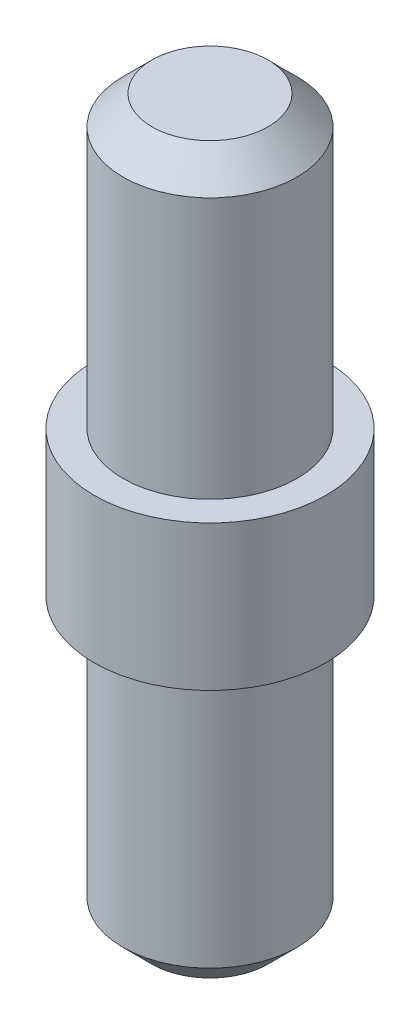
ISO-10303-21;
HEADER;
FILE_DESCRIPTION(('STEP AP214'),'2;1');
FILE_NAME('part.step','',(''),(''),'','','');
FILE_SCHEMA(('AUTOMOTIVE_DESIGN { 1 0 10303 214 1 1 1 1 }'));
ENDSEC;
DATA;
#1=APPLICATION_CONTEXT('core data for automotive mechanical design processes');
#2=APPLICATION_PROTOCOL_DEFINITION('international standard','automotive_design',2000,#1);
#3=PRODUCT_CONTEXT('',#1,'mechanical');
#4=PRODUCT('Part','Part','',(#3));
#5=PRODUCT_RELATED_PRODUCT_CATEGORY('part','',(#4));
#6=PRODUCT_DEFINITION_FORMATION('','',#4);
#7=PRODUCT_DEFINITION_CONTEXT('part definition',#1,'design');
#8=PRODUCT_DEFINITION('design','',#6,#7);
#9=PRODUCT_DEFINITION_SHAPE('','',#8);
#10=(LENGTH_UNIT() NAMED_UNIT(*) SI_UNIT(.MILLI.,.METRE.));
#11=(NAMED_UNIT(*) PLANE_ANGLE_UNIT() SI_UNIT($,.RADIAN.));
#12=(NAMED_UNIT(*) SI_UNIT($,.STERADIAN.) SOLID_ANGLE_UNIT());
#13=UNCERTAINTY_MEASURE_WITH_UNIT(LENGTH_MEASURE(1.E-05),#10,'distance_accuracy_value','');
#14=(GEOMETRIC_REPRESENTATION_CONTEXT(3) GLOBAL_UNCERTAINTY_ASSIGNED_CONTEXT((#13)) GLOBAL_UNIT_ASSIGNED_CONTEXT((#10,
#11,#12)) REPRESENTATION_CONTEXT('',''));
#15=CARTESIAN_POINT('',(0.,0.,0.));
#16=DIRECTION('',(0.,0.,1.));
#17=DIRECTION('',(1.,0.,0.));
#18=AXIS2_PLACEMENT_3D('',#15,#16,#17);
#19=CARTESIAN_POINT('',(0.,0.,0.));
#20=DIRECTION('',(0.,1.,0.));
#21=DIRECTION('',(0.,0.,1.));
#22=AXIS2_PLACEMENT_3D('',#19,#20,#21);
#23=PLANE('',#22);
#24=CARTESIAN_POINT('',(0.,0.,0.));
#25=DIRECTION('',(0.,1.,0.));
#26=DIRECTION('',(0.,0.,1.));
#27=AXIS2_PLACEMENT_3D('',#24,#25,#26);
#28=CIRCLE('',#27,2.00000000000001);
#29=CARTESIAN_POINT('',(0.,0.,2.00000000000001));
#30=VERTEX_POINT('',#29);
#31=EDGE_CURVE('E10',#30,#30,#28,.T.);
#32=ORIENTED_EDGE('',*,*,#31,.F.);
#33=EDGE_LOOP('',(#32));
#34=FACE_BOUND('',#33,.T.);
#35=ADVANCED_FACE('F35',(#34),#23,.F.);
#36=CARTESIAN_POINT('',(0.,0.,0.));
#37=DIRECTION('',(0.,1.,0.));
#38=DIRECTION('',(0.,0.,1.));
#39=AXIS2_PLACEMENT_3D('',#36,#37,#38);
#40=CONICAL_SURFACE('',#39,2.00000000000001,0.785398163397448);
#41=CARTESIAN_POINT('',(0.,1.,0.));
#42=DIRECTION('',(0.,1.,0.));
#43=DIRECTION('',(0.,0.,1.));
#44=AXIS2_PLACEMENT_3D('',#41,#42,#43);
#45=CIRCLE('',#44,3.00000000000001);
#46=CARTESIAN_POINT('',(0.,1.,3.00000000000001));
#47=VERTEX_POINT('',#46);
#48=EDGE_CURVE('E41',#47,#47,#45,.T.);
#49=ORIENTED_EDGE('',*,*,#48,.F.);
#50=EDGE_LOOP('',(#49));
#51=FACE_BOUND('',#50,.T.);
#52=ORIENTED_EDGE('',*,*,#31,.T.);
#53=EDGE_LOOP('',(#52));
#54=FACE_BOUND('',#53,.T.);
#55=ADVANCED_FACE('F101',(#51,#54),#40,.T.);
#56=CARTESIAN_POINT('',(0.,66.7583318306461,0.));
#57=DIRECTION('',(0.,1.,0.));
#58=DIRECTION('',(0.,0.,1.));
#59=AXIS2_PLACEMENT_3D('',#56,#57,#58);
#60=CYLINDRICAL_SURFACE('',#59,3.00000000000001);
#61=CARTESIAN_POINT('',(0.,10.,0.));
#62=DIRECTION('',(0.,1.,0.));
#63=DIRECTION('',(0.,0.,1.));
#64=AXIS2_PLACEMENT_3D('',#61,#62,#63);
#65=CIRCLE('',#64,3.00000000000001);
#66=CARTESIAN_POINT('',(0.,10.,3.00000000000001));
#67=VERTEX_POINT('',#66);
#68=EDGE_CURVE('E45',#67,#67,#65,.T.);
#69=ORIENTED_EDGE('',*,*,#68,.F.);
#70=EDGE_LOOP('',(#69));
#71=FACE_BOUND('',#70,.T.);
#72=ORIENTED_EDGE('',*,*,#48,.T.);
#73=EDGE_LOOP('',(#72));
#74=FACE_BOUND('',#73,.T.);
#75=ADVANCED_FACE('F96',(#71,#74),#60,.T.);
#76=CARTESIAN_POINT('',(3.00000000000001,10.,0.));
#77=DIRECTION('',(0.,1.,0.));
#78=DIRECTION('',(0.,0.,1.));
#79=AXIS2_PLACEMENT_3D('',#76,#77,#78);
#80=PLANE('',#79);
#81=CARTESIAN_POINT('',(0.,10.,0.));
#82=DIRECTION('',(0.,1.,0.));
#83=DIRECTION('',(0.,0.,1.));
#84=AXIS2_PLACEMENT_3D('',#81,#82,#83);
#85=CIRCLE('',#84,4.00000000000001);
#86=CARTESIAN_POINT('',(0.,10.,4.00000000000001));
#87=VERTEX_POINT('',#86);
#88=EDGE_CURVE('E49',#87,#87,#85,.T.);
#89=ORIENTED_EDGE('',*,*,#88,.F.);
#90=EDGE_LOOP('',(#89));
#91=FACE_BOUND('',#90,.T.);
#92=ORIENTED_EDGE('',*,*,#68,.T.);
#93=EDGE_LOOP('',(#92));
#94=FACE_BOUND('',#93,.T.);
#95=ADVANCED_FACE('F90',(#91,#94),#80,.F.);
#96=CARTESIAN_POINT('',(0.,66.7583318306461,0.));
#97=DIRECTION('',(0.,1.,0.));
#98=DIRECTION('',(0.,0.,1.));
#99=AXIS2_PLACEMENT_3D('',#96,#97,#98);
#100=CYLINDRICAL_SURFACE('',#99,4.00000000000001);
#101=CARTESIAN_POINT('',(0.,15.,0.));
#102=DIRECTION('',(0.,1.,0.));
#103=DIRECTION('',(0.,0.,1.));
#104=AXIS2_PLACEMENT_3D('',#101,#102,#103);
#105=CIRCLE('',#104,4.00000000000001);
#106=CARTESIAN_POINT('',(0.,15.,4.00000000000001));
#107=VERTEX_POINT('',#106);
#108=EDGE_CURVE('E54',#107,#107,#105,.T.);
#109=ORIENTED_EDGE('',*,*,#108,.F.);
#110=EDGE_LOOP('',(#109));
#111=FACE_BOUND('',#110,.T.);
#112=ORIENTED_EDGE('',*,*,#88,.T.);
#113=EDGE_LOOP('',(#112));
#114=FACE_BOUND('',#113,.T.);
#115=ADVANCED_FACE('F84',(#111,#114),#100,.T.);
#116=CARTESIAN_POINT('',(3.00000000000001,15.,0.));
#117=DIRECTION('',(0.,-1.,0.));
#118=DIRECTION('',(0.,0.,-1.));
#119=AXIS2_PLACEMENT_3D('',#116,#117,#118);
#120=PLANE('',#119);
#121=CARTESIAN_POINT('',(0.,15.,0.));
#122=DIRECTION('',(0.,1.,0.));
#123=DIRECTION('',(0.,0.,1.));
#124=AXIS2_PLACEMENT_3D('',#121,#122,#123);
#125=CIRCLE('',#124,3.00000000000001);
#126=CARTESIAN_POINT('',(0.,15.,3.00000000000001));
#127=VERTEX_POINT('',#126);
#128=EDGE_CURVE('E57',#127,#127,#125,.T.);
#129=ORIENTED_EDGE('',*,*,#128,.F.);
#130=EDGE_LOOP('',(#129));
#131=FACE_BOUND('',#130,.T.);
#132=ORIENTED_EDGE('',*,*,#108,.T.);
#133=EDGE_LOOP('',(#132));
#134=FACE_BOUND('',#133,.T.);
#135=ADVANCED_FACE('F78',(#131,#134),#120,.F.);
#136=CARTESIAN_POINT('',(0.,66.7583318306461,0.));
#137=DIRECTION('',(0.,1.,0.));
#138=DIRECTION('',(0.,0.,1.));
#139=AXIS2_PLACEMENT_3D('',#136,#137,#138);
#140=CYLINDRICAL_SURFACE('',#139,3.00000000000001);
#141=CARTESIAN_POINT('',(0.,24.,0.));
#142=DIRECTION('',(0.,1.,0.));
#143=DIRECTION('',(0.,0.,1.));
#144=AXIS2_PLACEMENT_3D('',#141,#142,#143);
#145=CIRCLE('',#144,3.00000000000001);
#146=CARTESIAN_POINT('',(0.,24.,3.00000000000001));
#147=VERTEX_POINT('',#146);
#148=EDGE_CURVE('E60',#147,#147,#145,.T.);
#149=ORIENTED_EDGE('',*,*,#148,.F.);
#150=EDGE_LOOP('',(#149));
#151=FACE_BOUND('',#150,.T.);
#152=ORIENTED_EDGE('',*,*,#128,.T.);
#153=EDGE_LOOP('',(#152));
#154=FACE_BOUND('',#153,.T.);
#155=ADVANCED_FACE('F72',(#151,#154),#140,.T.);
#156=CARTESIAN_POINT('',(0.,24.,0.));
#157=DIRECTION('',(0.,-1.,0.));
#158=DIRECTION('',(0.,0.,-1.));
#159=AXIS2_PLACEMENT_3D('',#156,#157,#158);
#160=CONICAL_SURFACE('',#159,3.00000000000001,0.785398163397449);
#161=CARTESIAN_POINT('',(0.,25.,0.));
#162=DIRECTION('',(0.,1.,0.));
#163=DIRECTION('',(0.,0.,1.));
#164=AXIS2_PLACEMENT_3D('',#161,#162,#163);
#165=CIRCLE('',#164,2.);
#166=CARTESIAN_POINT('',(0.,25.,2.));
#167=VERTEX_POINT('',#166);
#168=EDGE_CURVE('E63',#167,#167,#165,.T.);
#169=ORIENTED_EDGE('',*,*,#168,.F.);
#170=EDGE_LOOP('',(#169));
#171=FACE_BOUND('',#170,.T.);
#172=ORIENTED_EDGE('',*,*,#148,.T.);
#173=EDGE_LOOP('',(#172));
#174=FACE_BOUND('',#173,.T.);
#175=ADVANCED_FACE('F69',(#171,#174),#160,.T.);
#176=CARTESIAN_POINT('',(0.,25.,0.));
#177=DIRECTION('',(0.,-1.,0.));
#178=DIRECTION('',(0.,0.,-1.));
#179=AXIS2_PLACEMENT_3D('',#176,#177,#178);
#180=PLANE('',#179);
#181=ORIENTED_EDGE('',*,*,#168,.T.);
#182=EDGE_LOOP('',(#181));
#183=FACE_BOUND('',#182,.T.);
#184=ADVANCED_FACE('F67',(#183),#180,.F.);
#185=CLOSED_SHELL('',(#35,#55,#75,#95,#115,#135,#155,#175,#184));
#186=MANIFOLD_SOLID_BREP('B2',#185);
#187=ADVANCED_BREP_SHAPE_REPRESENTATION('',(#18,#186),#14);
#188=SHAPE_DEFINITION_REPRESENTATION(#9,#187);
ENDSEC;
END-ISO-10303-21;
